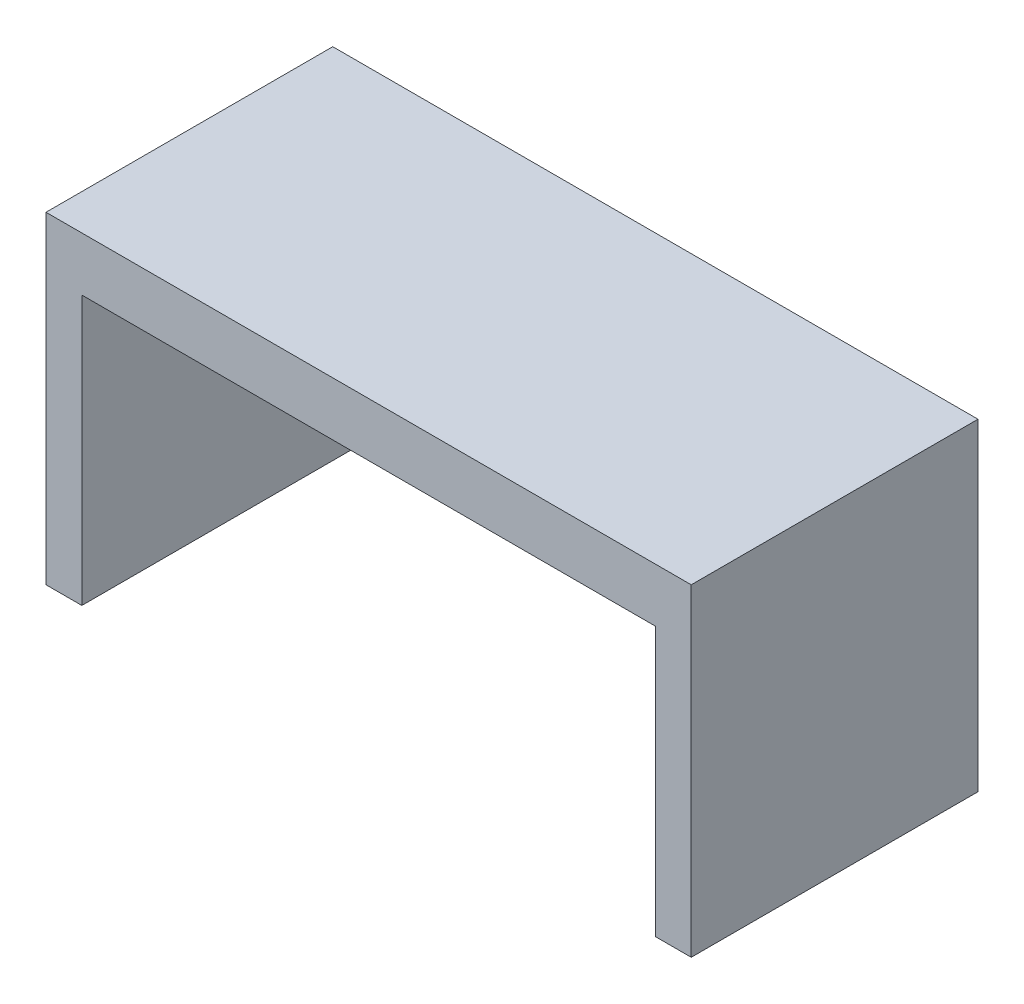
ISO-10303-21;
HEADER;
FILE_DESCRIPTION(('STEP AP214'),'2;1');
FILE_NAME('part.step','',(''),(''),'','','');
FILE_SCHEMA(('AUTOMOTIVE_DESIGN { 1 0 10303 214 1 1 1 1 }'));
ENDSEC;
DATA;
#1=APPLICATION_CONTEXT('core data for automotive mechanical design processes');
#2=APPLICATION_PROTOCOL_DEFINITION('international standard','automotive_design',2000,#1);
#3=PRODUCT_CONTEXT('',#1,'mechanical');
#4=PRODUCT('Part','Part','',(#3));
#5=PRODUCT_RELATED_PRODUCT_CATEGORY('part','',(#4));
#6=PRODUCT_DEFINITION_FORMATION('','',#4);
#7=PRODUCT_DEFINITION_CONTEXT('part definition',#1,'design');
#8=PRODUCT_DEFINITION('design','',#6,#7);
#9=PRODUCT_DEFINITION_SHAPE('','',#8);
#10=(LENGTH_UNIT() NAMED_UNIT(*) SI_UNIT(.MILLI.,.METRE.));
#11=(NAMED_UNIT(*) PLANE_ANGLE_UNIT() SI_UNIT($,.RADIAN.));
#12=(NAMED_UNIT(*) SI_UNIT($,.STERADIAN.) SOLID_ANGLE_UNIT());
#13=UNCERTAINTY_MEASURE_WITH_UNIT(LENGTH_MEASURE(1.E-05),#10,'distance_accuracy_value','');
#14=(GEOMETRIC_REPRESENTATION_CONTEXT(3) GLOBAL_UNCERTAINTY_ASSIGNED_CONTEXT((#13)) GLOBAL_UNIT_ASSIGNED_CONTEXT((#10,
#11,#12)) REPRESENTATION_CONTEXT('',''));
#15=CARTESIAN_POINT('',(0.,0.,0.));
#16=DIRECTION('',(0.,0.,1.));
#17=DIRECTION('',(1.,0.,0.));
#18=AXIS2_PLACEMENT_3D('',#15,#16,#17);
#19=CARTESIAN_POINT('',(-3.06122448979584,730.,77.5510204081633));
#20=DIRECTION('',(0.,1.,0.));
#21=DIRECTION('',(0.,0.,1.));
#22=AXIS2_PLACEMENT_3D('',#19,#20,#21);
#23=CYLINDRICAL_SURFACE('',#22,22.2364769721664);
#24=CARTESIAN_POINT('',(-3.06122448979584,730.,77.5510204081633));
#25=DIRECTION('',(0.,-1.,0.));
#26=DIRECTION('',(0.,0.,-1.));
#27=AXIS2_PLACEMENT_3D('',#24,#25,#26);
#28=CIRCLE('',#27,22.2364769721664);
#29=CARTESIAN_POINT('',(-3.06122448979584,730.,55.3145434359969));
#30=VERTEX_POINT('',#29);
#31=EDGE_CURVE('E11',#30,#30,#28,.T.);
#32=ORIENTED_EDGE('',*,*,#31,.F.);
#33=EDGE_LOOP('',(#32));
#34=FACE_BOUND('',#33,.T.);
#35=CARTESIAN_POINT('',(-3.06122448979584,750.,77.5510204081633));
#36=DIRECTION('',(0.,-1.,0.));
#37=DIRECTION('',(0.,0.,-1.));
#38=AXIS2_PLACEMENT_3D('',#35,#36,#37);
#39=CIRCLE('',#38,22.2364769721664);
#40=CARTESIAN_POINT('',(-3.06122448979584,750.,55.3145434359969));
#41=VERTEX_POINT('',#40);
#42=EDGE_CURVE('E50',#41,#41,#39,.T.);
#43=ORIENTED_EDGE('',*,*,#42,.T.);
#44=EDGE_LOOP('',(#43));
#45=FACE_BOUND('',#44,.T.);
#46=ADVANCED_FACE('F47',(#34,#45),#23,.T.);
#47=CARTESIAN_POINT('',(-3.06122448979584,730.,77.5510204081633));
#48=DIRECTION('',(0.,-1.,0.));
#49=DIRECTION('',(0.,0.,-1.));
#50=AXIS2_PLACEMENT_3D('',#47,#48,#49);
#51=PLANE('',#50);
#52=ORIENTED_EDGE('',*,*,#31,.T.);
#53=EDGE_LOOP('',(#52));
#54=FACE_BOUND('',#53,.T.);
#55=ADVANCED_FACE('F62',(#54),#51,.T.);
#56=CARTESIAN_POINT('',(-3.06122448979584,750.,77.5510204081633));
#57=DIRECTION('',(0.,-1.,0.));
#58=DIRECTION('',(0.,0.,-1.));
#59=AXIS2_PLACEMENT_3D('',#56,#57,#58);
#60=PLANE('',#59);
#61=ORIENTED_EDGE('',*,*,#42,.F.);
#62=EDGE_LOOP('',(#61));
#63=FACE_BOUND('',#62,.T.);
#64=ADVANCED_FACE('F60',(#63),#60,.F.);
#65=CLOSED_SHELL('',(#46,#55,#64));
#66=MANIFOLD_SOLID_BREP('B2',#65);
#67=CARTESIAN_POINT('',(0.,0.,0.));
#68=DIRECTION('',(0.,1.,0.));
#69=DIRECTION('',(0.,0.,1.));
#70=AXIS2_PLACEMENT_3D('',#67,#68,#69);
#71=PLANE('',#70);
#72=DIRECTION('',(-1.,0.,0.));
#73=VECTOR('',#72,1.);
#74=CARTESIAN_POINT('',(-903.061224489796,0.,-272.448979591837));
#75=LINE('',#74,#73);
#76=CARTESIAN_POINT('',(-803.061224489796,0.,-272.448979591837));
#77=VERTEX_POINT('',#76);
#78=CARTESIAN_POINT('',(-903.061224489796,0.,-272.448979591837));
#79=VERTEX_POINT('',#78);
#80=EDGE_CURVE('E139',#77,#79,#75,.T.);
#81=ORIENTED_EDGE('',*,*,#80,.F.);
#82=DIRECTION('',(0.,0.,1.));
#83=VECTOR('',#82,1.);
#84=CARTESIAN_POINT('',(-803.061224489796,0.,0.));
#85=LINE('',#84,#83);
#86=CARTESIAN_POINT('',(-803.061224489796,0.,527.551020408163));
#87=VERTEX_POINT('',#86);
#88=EDGE_CURVE('E102',#77,#87,#85,.T.);
#89=ORIENTED_EDGE('',*,*,#88,.T.);
#90=DIRECTION('',(1.,0.,0.));
#91=VECTOR('',#90,1.);
#92=CARTESIAN_POINT('',(-903.061224489796,0.,527.551020408163));
#93=LINE('',#92,#91);
#94=CARTESIAN_POINT('',(-903.061224489796,0.,527.551020408163));
#95=VERTEX_POINT('',#94);
#96=EDGE_CURVE('E181',#95,#87,#93,.T.);
#97=ORIENTED_EDGE('',*,*,#96,.F.);
#98=DIRECTION('',(0.,0.,1.));
#99=VECTOR('',#98,1.);
#100=CARTESIAN_POINT('',(-903.061224489796,0.,-272.448979591837));
#101=LINE('',#100,#99);
#102=EDGE_CURVE('E191',#79,#95,#101,.T.);
#103=ORIENTED_EDGE('',*,*,#102,.F.);
#104=EDGE_LOOP('',(#81,#89,#97,#103));
#105=FACE_BOUND('',#104,.T.);
#106=ADVANCED_FACE('F94',(#105),#71,.F.);
#107=CARTESIAN_POINT('',(-903.061224489796,900.,-272.448979591837));
#108=DIRECTION('',(1.,0.,0.));
#109=DIRECTION('',(0.,0.,-1.));
#110=AXIS2_PLACEMENT_3D('',#107,#108,#109);
#111=PLANE('',#110);
#112=ORIENTED_EDGE('',*,*,#102,.T.);
#113=DIRECTION('',(0.,-1.,0.));
#114=VECTOR('',#113,1.);
#115=CARTESIAN_POINT('',(-903.061224489796,900.,527.551020408163));
#116=LINE('',#115,#114);
#117=CARTESIAN_POINT('',(-903.061224489796,900.,527.551020408163));
#118=VERTEX_POINT('',#117);
#119=EDGE_CURVE('E185',#118,#95,#116,.T.);
#120=ORIENTED_EDGE('',*,*,#119,.F.);
#121=DIRECTION('',(0.,0.,1.));
#122=VECTOR('',#121,1.);
#123=CARTESIAN_POINT('',(-903.061224489796,900.,-272.448979591837));
#124=LINE('',#123,#122);
#125=CARTESIAN_POINT('',(-903.061224489796,900.,-272.448979591837));
#126=VERTEX_POINT('',#125);
#127=EDGE_CURVE('E198',#126,#118,#124,.T.);
#128=ORIENTED_EDGE('',*,*,#127,.F.);
#129=DIRECTION('',(0.,-1.,0.));
#130=VECTOR('',#129,1.);
#131=CARTESIAN_POINT('',(-903.061224489796,900.,-272.448979591837));
#132=LINE('',#131,#130);
#133=EDGE_CURVE('E199',#126,#79,#132,.T.);
#134=ORIENTED_EDGE('',*,*,#133,.T.);
#135=EDGE_LOOP('',(#112,#120,#128,#134));
#136=FACE_BOUND('',#135,.T.);
#137=ADVANCED_FACE('F96',(#136),#111,.F.);
#138=CARTESIAN_POINT('',(-903.061224489796,900.,527.551020408163));
#139=DIRECTION('',(0.,0.,-1.));
#140=DIRECTION('',(-1.,0.,0.));
#141=AXIS2_PLACEMENT_3D('',#138,#139,#140);
#142=PLANE('',#141);
#143=ORIENTED_EDGE('',*,*,#96,.T.);
#144=DIRECTION('',(0.,-1.,0.));
#145=VECTOR('',#144,1.);
#146=CARTESIAN_POINT('',(-803.061224489796,750.,527.551020408163));
#147=LINE('',#146,#145);
#148=CARTESIAN_POINT('',(-803.061224489796,750.,527.551020408163));
#149=VERTEX_POINT('',#148);
#150=EDGE_CURVE('E169',#149,#87,#147,.T.);
#151=ORIENTED_EDGE('',*,*,#150,.F.);
#152=DIRECTION('',(-1.,0.,0.));
#153=VECTOR('',#152,1.);
#154=CARTESIAN_POINT('',(-803.061224489796,750.,527.551020408163));
#155=LINE('',#154,#153);
#156=CARTESIAN_POINT('',(796.938775510204,750.,527.551020408163));
#157=VERTEX_POINT('',#156);
#158=EDGE_CURVE('E221',#157,#149,#155,.T.);
#159=ORIENTED_EDGE('',*,*,#158,.F.);
#160=DIRECTION('',(0.,1.,0.));
#161=VECTOR('',#160,1.);
#162=CARTESIAN_POINT('',(796.938775510204,750.,527.551020408163));
#163=LINE('',#162,#161);
#164=CARTESIAN_POINT('',(796.938775510204,0.,527.551020408163));
#165=VERTEX_POINT('',#164);
#166=EDGE_CURVE('E177',#165,#157,#163,.T.);
#167=ORIENTED_EDGE('',*,*,#166,.F.);
#168=CARTESIAN_POINT('',(896.938775510204,0.,527.551020408163));
#169=VERTEX_POINT('',#168);
#170=EDGE_CURVE('E188',#165,#169,#93,.T.);
#171=ORIENTED_EDGE('',*,*,#170,.T.);
#172=DIRECTION('',(0.,-1.,0.));
#173=VECTOR('',#172,1.);
#174=CARTESIAN_POINT('',(896.938775510204,900.,527.551020408163));
#175=LINE('',#174,#173);
#176=CARTESIAN_POINT('',(896.938775510204,900.,527.551020408163));
#177=VERTEX_POINT('',#176);
#178=EDGE_CURVE('E204',#177,#169,#175,.T.);
#179=ORIENTED_EDGE('',*,*,#178,.F.);
#180=DIRECTION('',(1.,0.,0.));
#181=VECTOR('',#180,1.);
#182=CARTESIAN_POINT('',(-903.061224489796,900.,527.551020408163));
#183=LINE('',#182,#181);
#184=EDGE_CURVE('E147',#118,#177,#183,.T.);
#185=ORIENTED_EDGE('',*,*,#184,.F.);
#186=ORIENTED_EDGE('',*,*,#119,.T.);
#187=EDGE_LOOP('',(#143,#151,#159,#167,#171,#179,#185,#186));
#188=FACE_BOUND('',#187,.T.);
#189=ADVANCED_FACE('F183',(#188),#142,.F.);
#190=CARTESIAN_POINT('',(896.938775510204,900.,-272.448979591837));
#191=DIRECTION('',(-1.,0.,0.));
#192=DIRECTION('',(0.,0.,1.));
#193=AXIS2_PLACEMENT_3D('',#190,#191,#192);
#194=PLANE('',#193);
#195=DIRECTION('',(0.,0.,-1.));
#196=VECTOR('',#195,1.);
#197=CARTESIAN_POINT('',(896.938775510204,0.,-272.448979591837));
#198=LINE('',#197,#196);
#199=CARTESIAN_POINT('',(896.938775510204,0.,-272.448979591837));
#200=VERTEX_POINT('',#199);
#201=EDGE_CURVE('E187',#169,#200,#198,.T.);
#202=ORIENTED_EDGE('',*,*,#201,.T.);
#203=DIRECTION('',(0.,-1.,0.));
#204=VECTOR('',#203,1.);
#205=CARTESIAN_POINT('',(896.938775510204,900.,-272.448979591837));
#206=LINE('',#205,#204);
#207=CARTESIAN_POINT('',(896.938775510204,900.,-272.448979591837));
#208=VERTEX_POINT('',#207);
#209=EDGE_CURVE('E201',#208,#200,#206,.T.);
#210=ORIENTED_EDGE('',*,*,#209,.F.);
#211=DIRECTION('',(0.,0.,-1.));
#212=VECTOR('',#211,1.);
#213=CARTESIAN_POINT('',(896.938775510204,900.,-272.448979591837));
#214=LINE('',#213,#212);
#215=EDGE_CURVE('E220',#177,#208,#214,.T.);
#216=ORIENTED_EDGE('',*,*,#215,.F.);
#217=ORIENTED_EDGE('',*,*,#178,.T.);
#218=EDGE_LOOP('',(#202,#210,#216,#217));
#219=FACE_BOUND('',#218,.T.);
#220=ADVANCED_FACE('F219',(#219),#194,.F.);
#221=CARTESIAN_POINT('',(-903.061224489796,900.,-272.448979591837));
#222=DIRECTION('',(0.,0.,1.));
#223=DIRECTION('',(1.,0.,0.));
#224=AXIS2_PLACEMENT_3D('',#221,#222,#223);
#225=PLANE('',#224);
#226=DIRECTION('',(-1.,0.,0.));
#227=VECTOR('',#226,1.);
#228=CARTESIAN_POINT('',(-903.061224489796,750.,-272.448979591837));
#229=LINE('',#228,#227);
#230=CARTESIAN_POINT('',(796.938775510204,750.,-272.448979591837));
#231=VERTEX_POINT('',#230);
#232=CARTESIAN_POINT('',(-803.061224489796,750.,-272.448979591837));
#233=VERTEX_POINT('',#232);
#234=EDGE_CURVE('E45',#231,#233,#229,.T.);
#235=ORIENTED_EDGE('',*,*,#234,.T.);
#236=DIRECTION('',(0.,-1.,0.));
#237=VECTOR('',#236,1.);
#238=CARTESIAN_POINT('',(-803.061224489796,900.,-272.448979591837));
#239=LINE('',#238,#237);
#240=EDGE_CURVE('E229',#233,#77,#239,.T.);
#241=ORIENTED_EDGE('',*,*,#240,.T.);
#242=ORIENTED_EDGE('',*,*,#80,.T.);
#243=ORIENTED_EDGE('',*,*,#133,.F.);
#244=DIRECTION('',(-1.,0.,0.));
#245=VECTOR('',#244,1.);
#246=CARTESIAN_POINT('',(-903.061224489796,900.,-272.448979591837));
#247=LINE('',#246,#245);
#248=EDGE_CURVE('E118',#208,#126,#247,.T.);
#249=ORIENTED_EDGE('',*,*,#248,.F.);
#250=ORIENTED_EDGE('',*,*,#209,.T.);
#251=CARTESIAN_POINT('',(796.938775510204,0.,-272.448979591837));
#252=VERTEX_POINT('',#251);
#253=EDGE_CURVE('E195',#200,#252,#75,.T.);
#254=ORIENTED_EDGE('',*,*,#253,.T.);
#255=DIRECTION('',(0.,1.,0.));
#256=VECTOR('',#255,1.);
#257=CARTESIAN_POINT('',(796.938775510204,900.,-272.448979591837));
#258=LINE('',#257,#256);
#259=EDGE_CURVE('E109',#252,#231,#258,.T.);
#260=ORIENTED_EDGE('',*,*,#259,.T.);
#261=EDGE_LOOP('',(#235,#241,#242,#243,#249,#250,#254,#260));
#262=FACE_BOUND('',#261,.T.);
#263=ADVANCED_FACE('F215',(#262),#225,.F.);
#264=CARTESIAN_POINT('',(0.,900.,0.));
#265=DIRECTION('',(0.,1.,0.));
#266=DIRECTION('',(0.,0.,1.));
#267=AXIS2_PLACEMENT_3D('',#264,#265,#266);
#268=PLANE('',#267);
#269=ORIENTED_EDGE('',*,*,#127,.T.);
#270=ORIENTED_EDGE('',*,*,#184,.T.);
#271=ORIENTED_EDGE('',*,*,#215,.T.);
#272=ORIENTED_EDGE('',*,*,#248,.T.);
#273=EDGE_LOOP('',(#269,#270,#271,#272));
#274=FACE_BOUND('',#273,.T.);
#275=ADVANCED_FACE('F233',(#274),#268,.T.);
#276=ORIENTED_EDGE('',*,*,#170,.F.);
#277=DIRECTION('',(0.,0.,-1.));
#278=VECTOR('',#277,1.);
#279=CARTESIAN_POINT('',(796.938775510204,0.,0.));
#280=LINE('',#279,#278);
#281=EDGE_CURVE('E182',#165,#252,#280,.T.);
#282=ORIENTED_EDGE('',*,*,#281,.T.);
#283=ORIENTED_EDGE('',*,*,#253,.F.);
#284=ORIENTED_EDGE('',*,*,#201,.F.);
#285=EDGE_LOOP('',(#276,#282,#283,#284));
#286=FACE_BOUND('',#285,.T.);
#287=ADVANCED_FACE('F211',(#286),#71,.F.);
#288=CARTESIAN_POINT('',(-803.061224489796,750.,-672.448979591837));
#289=DIRECTION('',(0.,1.,0.));
#290=DIRECTION('',(0.,0.,1.));
#291=AXIS2_PLACEMENT_3D('',#288,#289,#290);
#292=PLANE('',#291);
#293=DIRECTION('',(0.,0.,1.));
#294=VECTOR('',#293,1.);
#295=CARTESIAN_POINT('',(796.938775510204,750.,-672.448979591837));
#296=LINE('',#295,#294);
#297=EDGE_CURVE('E223',#231,#157,#296,.T.);
#298=ORIENTED_EDGE('',*,*,#297,.T.);
#299=ORIENTED_EDGE('',*,*,#158,.T.);
#300=DIRECTION('',(0.,0.,1.));
#301=VECTOR('',#300,1.);
#302=CARTESIAN_POINT('',(-803.061224489796,750.,-672.448979591837));
#303=LINE('',#302,#301);
#304=EDGE_CURVE('E173',#233,#149,#303,.T.);
#305=ORIENTED_EDGE('',*,*,#304,.F.);
#306=ORIENTED_EDGE('',*,*,#234,.F.);
#307=EDGE_LOOP('',(#298,#299,#305,#306));
#308=FACE_BOUND('',#307,.T.);
#309=ADVANCED_FACE('F247',(#308),#292,.F.);
#310=CARTESIAN_POINT('',(-803.061224489796,750.,-672.448979591837));
#311=DIRECTION('',(-1.,0.,0.));
#312=DIRECTION('',(0.,-1.,0.));
#313=AXIS2_PLACEMENT_3D('',#310,#311,#312);
#314=PLANE('',#313);
#315=ORIENTED_EDGE('',*,*,#304,.T.);
#316=ORIENTED_EDGE('',*,*,#150,.T.);
#317=ORIENTED_EDGE('',*,*,#88,.F.);
#318=ORIENTED_EDGE('',*,*,#240,.F.);
#319=EDGE_LOOP('',(#315,#316,#317,#318));
#320=FACE_BOUND('',#319,.T.);
#321=ADVANCED_FACE('F171',(#320),#314,.F.);
#322=CARTESIAN_POINT('',(796.938775510204,750.,-672.448979591837));
#323=DIRECTION('',(1.,0.,0.));
#324=DIRECTION('',(0.,1.,0.));
#325=AXIS2_PLACEMENT_3D('',#322,#323,#324);
#326=PLANE('',#325);
#327=ORIENTED_EDGE('',*,*,#281,.F.);
#328=ORIENTED_EDGE('',*,*,#166,.T.);
#329=ORIENTED_EDGE('',*,*,#297,.F.);
#330=ORIENTED_EDGE('',*,*,#259,.F.);
#331=EDGE_LOOP('',(#327,#328,#329,#330));
#332=FACE_BOUND('',#331,.T.);
#333=ADVANCED_FACE('F260',(#332),#326,.F.);
#334=CLOSED_SHELL('',(#106,#137,#189,#220,#263,#275,#287,#309,#321,#333));
#335=MANIFOLD_SOLID_BREP('B6',#334);
#336=ADVANCED_BREP_SHAPE_REPRESENTATION('',(#18,#66,#335),#14);
#337=SHAPE_DEFINITION_REPRESENTATION(#9,#336);
ENDSEC;
END-ISO-10303-21;
